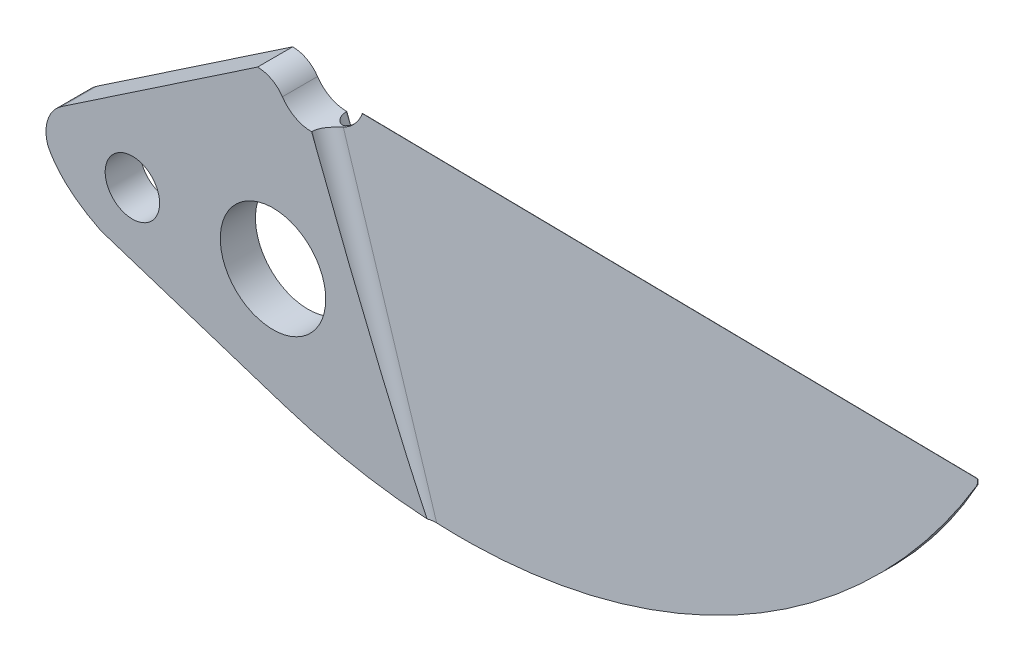
ISO-10303-21;
HEADER;
FILE_DESCRIPTION(('STEP AP214'),'2;1');
FILE_NAME('part.step','',(''),(''),'','','');
FILE_SCHEMA(('AUTOMOTIVE_DESIGN { 1 0 10303 214 1 1 1 1 }'));
ENDSEC;
DATA;
#1=APPLICATION_CONTEXT('core data for automotive mechanical design processes');
#2=APPLICATION_PROTOCOL_DEFINITION('international standard','automotive_design',2000,#1);
#3=PRODUCT_CONTEXT('',#1,'mechanical');
#4=PRODUCT('Part','Part','',(#3));
#5=PRODUCT_RELATED_PRODUCT_CATEGORY('part','',(#4));
#6=PRODUCT_DEFINITION_FORMATION('','',#4);
#7=PRODUCT_DEFINITION_CONTEXT('part definition',#1,'design');
#8=PRODUCT_DEFINITION('design','',#6,#7);
#9=PRODUCT_DEFINITION_SHAPE('','',#8);
#10=(LENGTH_UNIT() NAMED_UNIT(*) SI_UNIT(.MILLI.,.METRE.));
#11=(NAMED_UNIT(*) PLANE_ANGLE_UNIT() SI_UNIT($,.RADIAN.));
#12=(NAMED_UNIT(*) SI_UNIT($,.STERADIAN.) SOLID_ANGLE_UNIT());
#13=UNCERTAINTY_MEASURE_WITH_UNIT(LENGTH_MEASURE(1.E-05),#10,'distance_accuracy_value','');
#14=(GEOMETRIC_REPRESENTATION_CONTEXT(3) GLOBAL_UNCERTAINTY_ASSIGNED_CONTEXT((#13)) GLOBAL_UNIT_ASSIGNED_CONTEXT((#10,
#11,#12)) REPRESENTATION_CONTEXT('',''));
#15=CARTESIAN_POINT('',(0.,0.,0.));
#16=DIRECTION('',(0.,0.,1.));
#17=DIRECTION('',(1.,0.,0.));
#18=AXIS2_PLACEMENT_3D('',#15,#16,#17);
#19=CARTESIAN_POINT('',(8.2800869651625,-5.47751449154035,-1.67389681980654));
#20=DIRECTION('',(0.357944541525714,-0.932477410895465,-0.0485961249652377));
#21=DIRECTION('',(0.933580426497201,0.358367949545303,0.));
#22=AXIS2_PLACEMENT_3D('',#19,#20,#21);
#23=CYLINDRICAL_SURFACE('',#22,0.9);
#24=CARTESIAN_POINT('',(3.31636427381954,7.45342521184956,-1.));
#25=DIRECTION('',(0.,0.,1.));
#26=DIRECTION('',(0.358367949545303,-0.933580426497201,0.));
#27=AXIS2_PLACEMENT_3D('',#24,#25,#26);
#28=ELLIPSE('',#27,18.5199951774714,0.9);
#29=CARTESIAN_POINT('',(2.47614188997207,7.13089405725878,-1.));
#30=VERTEX_POINT('',#29);
#31=CARTESIAN_POINT('',(8.7708872621905,-7.94148829703764,-1.));
#32=VERTEX_POINT('',#31);
#33=EDGE_CURVE('E267',#30,#32,#28,.T.);
#34=ORIENTED_EDGE('',*,*,#33,.F.);
#35=DIRECTION('',(-0.357944541525714,0.932477410895465,0.0485961249652377));
#36=VECTOR('',#35,1.);
#37=CARTESIAN_POINT('',(7.43986458131502,-5.80004564613112,-1.67389681980654));
#38=LINE('',#37,#36);
#39=CARTESIAN_POINT('',(2.2,7.85026827512889,-0.962509762724638));
#40=VERTEX_POINT('',#39);
#41=EDGE_CURVE('E269',#40,#30,#38,.F.);
#42=ORIENTED_EDGE('',*,*,#41,.F.);
#43=CARTESIAN_POINT('',(3.06901821848776,8.04893339900609,-0.0677439758841017));
#44=CARTESIAN_POINT('',(3.04738711886484,8.03849552881779,-0.0683063534846447));
#45=CARTESIAN_POINT('',(3.02559596619507,8.02846610860135,-0.069806209494751));
#46=CARTESIAN_POINT('',(2.98184904882709,8.00926816414383,-0.0746761316194891));
#47=CARTESIAN_POINT('',(2.95989331594161,8.00009947793519,-0.0780458450479244));
#48=CARTESIAN_POINT('',(2.89417392234209,7.97401382623964,-0.0909194408252502));
#49=CARTESIAN_POINT('',(2.85038445244756,7.95843401010548,-0.103192359199342));
#50=CARTESIAN_POINT('',(2.76425472923656,7.93098044075325,-0.134779006636601));
#51=CARTESIAN_POINT('',(2.72191427187643,7.91910616380952,-0.154091739883988));
#52=CARTESIAN_POINT('',(2.63993826613543,7.89879729652735,-0.199216890080445));
#53=CARTESIAN_POINT('',(2.6003042081508,7.89036458891915,-0.225032852203651));
#54=CARTESIAN_POINT('',(2.52380394954619,7.87625929709121,-0.283377957503825));
#55=CARTESIAN_POINT('',(2.48705847577758,7.87067838583808,-0.316087279367703));
#56=CARTESIAN_POINT('',(2.41887969978816,7.86198385016072,-0.38694109927238));
#57=CARTESIAN_POINT('',(2.3874483970294,7.85887115278618,-0.425087633164483));
#58=CARTESIAN_POINT('',(2.3298205576978,7.85426749897936,-0.507650647545117));
#59=CARTESIAN_POINT('',(2.30389647289797,7.85284946357172,-0.552262057947021));
#60=CARTESIAN_POINT('',(2.26016007711158,7.85105282242732,-0.645294988801989));
#61=CARTESIAN_POINT('',(2.24233917328069,7.85067311346634,-0.693712409027086));
#62=CARTESIAN_POINT('',(2.21942194127938,7.85033882020424,-0.779004693557293));
#63=CARTESIAN_POINT('',(2.21215881601434,7.85029488682602,-0.815309427738365));
#64=CARTESIAN_POINT('',(2.20243561216963,7.85026829014279,-0.888571242136176));
#65=CARTESIAN_POINT('',(2.19997765048983,7.85028565383257,-0.92552860263432));
#66=CARTESIAN_POINT('',(2.2,7.85026827512889,-0.962509762724637));
#67=B_SPLINE_CURVE_WITH_KNOTS('',3,(#43,#44,#45,#46,#47,#48,#49,#50,#51,#52,#53,#54,#55,#56,#57,
#58,#59,#60,#61,#62,#63,#64,#65,#66),.UNSPECIFIED.,.F.,.F.,(4,2,2,2,2,2,2,2,2,2,2,4),(0.,
0.0720281930726787,0.1440428050463,0.287501900272176,0.430940710386766,0.574457884681114,
0.722336755169682,0.870271142002736,1.02436509657995,1.17829526224761,1.28906455524821,
1.39988263632901),.UNSPECIFIED.);
#68=CARTESIAN_POINT('',(3.06901821848776,8.04893339900609,-0.0677439758841017));
#69=VERTEX_POINT('',#68);
#70=EDGE_CURVE('E240',#40,#69,#67,.F.);
#71=ORIENTED_EDGE('',*,*,#70,.T.);
#72=DIRECTION('',(-0.357944541525714,0.932477410895465,0.0485961249652377));
#73=VECTOR('',#72,1.);
#74=CARTESIAN_POINT('',(8.27941414294834,-5.52461204653122,-0.775130238527423));
#75=LINE('',#74,#73);
#76=CARTESIAN_POINT('',(9.21616331207181,-7.96492706337582,-0.902307424942313));
#77=VERTEX_POINT('',#76);
#78=EDGE_CURVE('E278',#77,#69,#75,.T.);
#79=ORIENTED_EDGE('',*,*,#78,.F.);
#80=CARTESIAN_POINT('',(8.7708872621905,-7.94148829703764,-1.));
#81=CARTESIAN_POINT('',(8.82487068148805,-7.9447041897844,-0.974670081249899));
#82=CARTESIAN_POINT('',(8.88106165759478,-7.94790601053109,-0.954214629148441));
#83=CARTESIAN_POINT('',(8.99457155644889,-7.95406933881047,-0.923592847691602));
#84=CARTESIAN_POINT('',(9.05181933535197,-7.95703499621789,-0.913164229147659));
#85=CARTESIAN_POINT('',(9.16717355253638,-7.96269676119442,-0.901773544444883));
#86=CARTESIAN_POINT('',(9.22527876930779,-7.96539321637517,-0.900799109756322));
#87=CARTESIAN_POINT('',(9.34250182333011,-7.97052625485149,-0.908328996820005));
#88=CARTESIAN_POINT('',(9.40160325188754,-7.97295359399474,-0.917096085760459));
#89=CARTESIAN_POINT('',(9.45957224124534,-7.97517165401397,-0.930782380070947));
#90=B_SPLINE_CURVE_WITH_KNOTS('',3,(#80,#81,#82,#83,#84,#85,#86,#87,#88,#89),.UNSPECIFIED.,.F.,
.F.,(4,2,2,2,4),(0.,0.178812864998598,0.352809561578287,0.526578594512403,0.70515114895579),.UNSPECIFIED.);
#91=EDGE_CURVE('E248',#77,#32,#90,.F.);
#92=ORIENTED_EDGE('',*,*,#91,.T.);
#93=EDGE_LOOP('',(#34,#42,#71,#79,#92));
#94=FACE_BOUND('',#93,.T.);
#95=ADVANCED_FACE('F39',(#94),#23,.F.);
#96=CARTESIAN_POINT('',(2.2892800924129,10.129070981352,0.860558535082814));
#97=DIRECTION('',(0.357944541525714,-0.932477410895465,0.0485961249652377));
#98=DIRECTION('',(0.933580426497201,0.358367949545303,0.));
#99=AXIS2_PLACEMENT_3D('',#96,#97,#98);
#100=CYLINDRICAL_SURFACE('',#99,0.9);
#101=DIRECTION('',(0.357944541525714,-0.932477410895465,0.0485961249652377));
#102=VECTOR('',#101,1.);
#103=CARTESIAN_POINT('',(2.28860727019875,10.0819734263611,-0.0382080461963024));
#104=LINE('',#103,#102);
#105=CARTESIAN_POINT('',(3.06901821848776,8.04893339900609,0.0677439758841014));
#106=VERTEX_POINT('',#105);
#107=CARTESIAN_POINT('',(9.21616331207183,-7.96492706337582,0.902307424942312));
#108=VERTEX_POINT('',#107);
#109=EDGE_CURVE('E204',#106,#108,#104,.T.);
#110=ORIENTED_EDGE('',*,*,#109,.F.);
#111=CARTESIAN_POINT('',(2.2,7.85026827512889,0.962509762724639));
#112=CARTESIAN_POINT('',(2.19999809804876,7.85027101865456,0.938216920235091));
#113=CARTESIAN_POINT('',(2.20105188369925,7.8502680038347,0.913935927408645));
#114=CARTESIAN_POINT('',(2.20525200459821,7.85027351339869,0.865561870037675));
#115=CARTESIAN_POINT('',(2.20839779874032,7.85028203479924,0.841468758526827));
#116=CARTESIAN_POINT('',(2.22091068799788,7.85035924140511,0.769899367432101));
#117=CARTESIAN_POINT('',(2.2333536582733,7.85047920648801,0.722926549773713));
#118=CARTESIAN_POINT('',(2.26586976038441,7.85128819351617,0.631773449985123));
#119=CARTESIAN_POINT('',(2.28593944181042,7.85197695829512,0.587591915573065));
#120=CARTESIAN_POINT('',(2.33287601008231,7.85454910178014,0.503004556547711));
#121=CARTESIAN_POINT('',(2.35974793379163,7.85643336728422,0.462601560325799));
#122=CARTESIAN_POINT('',(2.42037724220708,7.86220591536161,0.385125042700949));
#123=CARTESIAN_POINT('',(2.45434701741513,7.86616365157841,0.348222914207002));
#124=CARTESIAN_POINT('',(2.52736503777638,7.87689755548643,0.28030967391197));
#125=CARTESIAN_POINT('',(2.56641392329902,7.88367407880488,0.249299306153709));
#126=CARTESIAN_POINT('',(2.64929060716319,7.90091724706654,0.193311690836765));
#127=CARTESIAN_POINT('',(2.69320960868409,7.91146739934345,0.168494529727756));
#128=CARTESIAN_POINT('',(2.783488897118,7.93670359961269,0.126660738807834));
#129=CARTESIAN_POINT('',(2.82984671025603,7.9513855199464,0.109636368313299));
#130=CARTESIAN_POINT('',(2.90865176839282,7.97971310159564,0.0879634290841387));
#131=CARTESIAN_POINT('',(2.94091110695246,7.99224458475626,0.0811090624673443));
#132=CARTESIAN_POINT('',(3.0052385640548,8.01919706361951,0.0714065998367637));
#133=CARTESIAN_POINT('',(3.03730669710264,8.03361791403512,0.0685581959731345));
#134=CARTESIAN_POINT('',(3.06901821848776,8.04893339900609,0.0677439758841018));
#135=B_SPLINE_CURVE_WITH_KNOTS('',3,(#111,#112,#113,#114,#115,#116,#117,#118,#119,#120,#121,
#122,#123,#124,#125,#126,#127,#128,#129,#130,#131,#132,#133,#134),.UNSPECIFIED.,.F.,.F.,(4,2,2,
2,2,2,2,2,2,2,2,4),(0.,0.0728322379780739,0.145645644929881,0.290661316063427,0.435611458436186,
0.580669247771913,0.730929790760232,0.881209296853106,1.035044082627,1.18872572886805,
1.29430211437038,1.39987038610532),.UNSPECIFIED.);
#136=CARTESIAN_POINT('',(2.2,7.85026827512889,0.962509762724639));
#137=VERTEX_POINT('',#136);
#138=EDGE_CURVE('E212',#106,#137,#135,.F.);
#139=ORIENTED_EDGE('',*,*,#138,.T.);
#140=DIRECTION('',(-0.357944541525714,0.932477410895465,-0.0485961249652377));
#141=VECTOR('',#140,1.);
#142=CARTESIAN_POINT('',(1.44905770856542,9.80653982676119,0.860558535082814));
#143=LINE('',#142,#141);
#144=CARTESIAN_POINT('',(2.47614188997207,7.13089405725878,1.));
#145=VERTEX_POINT('',#144);
#146=EDGE_CURVE('E207',#145,#137,#143,.T.);
#147=ORIENTED_EDGE('',*,*,#146,.F.);
#148=CARTESIAN_POINT('',(3.31636427381955,7.45342521184956,1.));
#149=DIRECTION('',(0.,0.,1.));
#150=DIRECTION('',(0.358367949545303,-0.933580426497201,0.));
#151=AXIS2_PLACEMENT_3D('',#148,#149,#150);
#152=ELLIPSE('',#151,18.5199951774714,0.9);
#153=CARTESIAN_POINT('',(8.7708872621905,-7.94148829703764,1.));
#154=VERTEX_POINT('',#153);
#155=EDGE_CURVE('E210',#154,#145,#152,.F.);
#156=ORIENTED_EDGE('',*,*,#155,.F.);
#157=CARTESIAN_POINT('',(8.7708872621905,-7.94148829703764,1.));
#158=CARTESIAN_POINT('',(8.82487068148805,-7.9447041897844,0.974670081249898));
#159=CARTESIAN_POINT('',(8.88106165759478,-7.94790601053109,0.95421462914844));
#160=CARTESIAN_POINT('',(8.99457155644889,-7.95406933881047,0.923592847691601));
#161=CARTESIAN_POINT('',(9.05181933535198,-7.95703499621789,0.913164229147659));
#162=CARTESIAN_POINT('',(9.16717355253638,-7.96269676119442,0.901773544444883));
#163=CARTESIAN_POINT('',(9.22527876930779,-7.96539321637517,0.900799109756322));
#164=CARTESIAN_POINT('',(9.34250182333011,-7.97052625485149,0.908328996820005));
#165=CARTESIAN_POINT('',(9.40160325188755,-7.97295359399474,0.917096085760459));
#166=CARTESIAN_POINT('',(9.45957224124534,-7.97517165401397,0.930782380070948));
#167=B_SPLINE_CURVE_WITH_KNOTS('',3,(#157,#158,#159,#160,#161,#162,#163,#164,#165,#166),
.UNSPECIFIED.,.F.,.F.,(4,2,2,2,4),(0.,0.178812864998599,0.352809561578287,0.526578594512401,
0.705151148955792),.UNSPECIFIED.);
#168=EDGE_CURVE('E220',#154,#108,#167,.T.);
#169=ORIENTED_EDGE('',*,*,#168,.T.);
#170=EDGE_LOOP('',(#110,#139,#147,#156,#169));
#171=FACE_BOUND('',#170,.T.);
#172=ADVANCED_FACE('F227',(#171),#100,.F.);
#173=CARTESIAN_POINT('',(4.5438866935335,1.74423468092352,1.));
#174=DIRECTION('',(0.933580426497201,0.358367949545303,0.));
#175=DIRECTION('',(-0.358367949545303,0.933580426497201,0.));
#176=AXIS2_PLACEMENT_3D('',#173,#174,#175);
#177=PLANE('',#176);
#178=DIRECTION('',(0.,0.,-1.));
#179=VECTOR('',#178,1.);
#180=CARTESIAN_POINT('',(2.2,7.85026827512889,1.));
#181=LINE('',#180,#179);
#182=CARTESIAN_POINT('',(2.2,7.85026827512889,-1.));
#183=VERTEX_POINT('',#182);
#184=EDGE_CURVE('E170',#40,#183,#181,.T.);
#185=ORIENTED_EDGE('',*,*,#184,.F.);
#186=ORIENTED_EDGE('',*,*,#41,.T.);
#187=DIRECTION('',(0.358367949545303,-0.933580426497201,0.));
#188=VECTOR('',#187,1.);
#189=CARTESIAN_POINT('',(4.5438866935335,1.74423468092352,-1.));
#190=LINE('',#189,#188);
#191=EDGE_CURVE('E276',#183,#30,#190,.T.);
#192=ORIENTED_EDGE('',*,*,#191,.F.);
#193=EDGE_LOOP('',(#185,#186,#192));
#194=FACE_BOUND('',#193,.T.);
#195=ADVANCED_FACE('F262',(#194),#177,.T.);
#196=CARTESIAN_POINT('',(-9.8,-3.01889749363505,1.));
#197=CARTESIAN_POINT('',(-12.0163663063261,-1.91939263561892,1.));
#198=CARTESIAN_POINT('',(-12.8,-0.352047083226039,1.));
#199=B_SPLINE_CURVE_WITH_KNOTS('',2,(#196,#197,#198),.UNSPECIFIED.,.F.,.F.,(3,3),(0.,
0.799118897655542),.UNSPECIFIED.);
#200=DIRECTION('',(0.,0.,-1.));
#201=VECTOR('',#200,1.);
#202=SURFACE_OF_LINEAR_EXTRUSION('',#199,#201);
#203=CARTESIAN_POINT('',(-9.8,-3.01889749363505,-1.));
#204=CARTESIAN_POINT('',(-12.0163663063261,-1.91939263561892,-1.));
#205=CARTESIAN_POINT('',(-12.8,-0.352047083226039,-1.));
#206=B_SPLINE_CURVE_WITH_KNOTS('',2,(#203,#204,#205),.UNSPECIFIED.,.F.,.F.,(3,3),(0.,
0.799118897655542),.UNSPECIFIED.);
#207=CARTESIAN_POINT('',(-9.8,-3.01889749363505,-1.));
#208=VERTEX_POINT('',#207);
#209=CARTESIAN_POINT('',(-12.8,-0.352047083226039,-1.));
#210=VERTEX_POINT('',#209);
#211=EDGE_CURVE('E349',#208,#210,#206,.T.);
#212=ORIENTED_EDGE('',*,*,#211,.F.);
#213=DIRECTION('',(0.,0.,-1.));
#214=VECTOR('',#213,1.);
#215=CARTESIAN_POINT('',(-9.8,-3.01889749363505,1.));
#216=LINE('',#215,#214);
#217=CARTESIAN_POINT('',(-9.8,-3.01889749363505,1.));
#218=VERTEX_POINT('',#217);
#219=EDGE_CURVE('E182',#218,#208,#216,.T.);
#220=ORIENTED_EDGE('',*,*,#219,.F.);
#221=CARTESIAN_POINT('',(-12.8,-0.352047083226039,1.));
#222=VERTEX_POINT('',#221);
#223=EDGE_CURVE('E293',#218,#222,#199,.T.);
#224=ORIENTED_EDGE('',*,*,#223,.T.);
#225=DIRECTION('',(0.,0.,-1.));
#226=VECTOR('',#225,1.);
#227=CARTESIAN_POINT('',(-12.8,-0.352047083226039,1.));
#228=LINE('',#227,#226);
#229=EDGE_CURVE('E168',#222,#210,#228,.T.);
#230=ORIENTED_EDGE('',*,*,#229,.T.);
#231=EDGE_LOOP('',(#212,#220,#224,#230));
#232=FACE_BOUND('',#231,.T.);
#233=ADVANCED_FACE('F314',(#232),#202,.T.);
#234=CARTESIAN_POINT('',(-1.82304844003346,-5.61076617136399,1.));
#235=DIRECTION('',(0.309016994374948,0.951056516295153,0.));
#236=DIRECTION('',(-0.951056516295153,0.309016994374948,0.));
#237=AXIS2_PLACEMENT_3D('',#234,#235,#236);
#238=PLANE('',#237);
#239=DIRECTION('',(0.951056516295153,-0.309016994374948,0.));
#240=VECTOR('',#239,1.);
#241=CARTESIAN_POINT('',(-1.82304844003346,-5.61076617136399,-1.));
#242=LINE('',#241,#240);
#243=CARTESIAN_POINT('',(0.59471388474998,-6.396344771496,-1.));
#244=VERTEX_POINT('',#243);
#245=EDGE_CURVE('E287',#208,#244,#242,.T.);
#246=ORIENTED_EDGE('',*,*,#245,.T.);
#247=DIRECTION('',(0.,0.,-1.));
#248=VECTOR('',#247,1.);
#249=CARTESIAN_POINT('',(0.59471388474998,-6.396344771496,1.));
#250=LINE('',#249,#248);
#251=CARTESIAN_POINT('',(0.59471388474998,-6.396344771496,1.));
#252=VERTEX_POINT('',#251);
#253=EDGE_CURVE('E179',#252,#244,#250,.T.);
#254=ORIENTED_EDGE('',*,*,#253,.F.);
#255=DIRECTION('',(0.951056516295153,-0.309016994374948,0.));
#256=VECTOR('',#255,1.);
#257=CARTESIAN_POINT('',(-1.82304844003346,-5.61076617136399,1.));
#258=LINE('',#257,#256);
#259=EDGE_CURVE('E296',#218,#252,#258,.T.);
#260=ORIENTED_EDGE('',*,*,#259,.F.);
#261=ORIENTED_EDGE('',*,*,#219,.T.);
#262=EDGE_LOOP('',(#246,#254,#260,#261));
#263=FACE_BOUND('',#262,.T.);
#264=ADVANCED_FACE('F318',(#263),#238,.F.);
#265=CARTESIAN_POINT('',(10.7150204505295,24.7507561371703,1.));
#266=DIRECTION('',(0.,0.,-1.));
#267=DIRECTION('',(-1.,0.,0.));
#268=AXIS2_PLACEMENT_3D('',#265,#266,#267);
#269=CYLINDRICAL_SURFACE('',#268,32.75);
#270=ORIENTED_EDGE('',*,*,#91,.F.);
#271=CARTESIAN_POINT('',(10.7150204505295,24.7507561371703,0.813196005087186));
#272=DIRECTION('',(0.000747580237950325,0.0523306166565225,-0.998629534754574));
#273=DIRECTION('',(-0.0142646807053726,-0.998527649376075,-0.052335956242951));
#274=AXIS2_PLACEMENT_3D('',#271,#272,#273);
#275=ELLIPSE('',#274,32.7949443314319,32.75);
#276=CARTESIAN_POINT('',(39.0913358163903,8.4,-0.0223807026157854));
#277=VERTEX_POINT('',#276);
#278=EDGE_CURVE('E194',#77,#277,#275,.F.);
#279=ORIENTED_EDGE('',*,*,#278,.T.);
#280=DIRECTION('',(0.,0.,-1.));
#281=VECTOR('',#280,1.);
#282=CARTESIAN_POINT('',(39.0913358163903,8.4,0.95));
#283=LINE('',#282,#281);
#284=CARTESIAN_POINT('',(39.0913358163903,8.4,0.0223807026157856));
#285=VERTEX_POINT('',#284);
#286=EDGE_CURVE('E307',#285,#277,#283,.T.);
#287=ORIENTED_EDGE('',*,*,#286,.F.);
#288=CARTESIAN_POINT('',(10.7150204505295,24.7507561371703,-0.813196005087187));
#289=DIRECTION('',(-0.000747580237950325,-0.0523306166565225,-0.998629534754574));
#290=DIRECTION('',(0.0142646807053726,0.998527649376075,-0.052335956242951));
#291=AXIS2_PLACEMENT_3D('',#288,#289,#290);
#292=ELLIPSE('',#291,32.7949443314319,32.75);
#293=EDGE_CURVE('E189',#285,#108,#292,.T.);
#294=ORIENTED_EDGE('',*,*,#293,.T.);
#295=ORIENTED_EDGE('',*,*,#168,.F.);
#296=CARTESIAN_POINT('',(10.7150204505295,24.7507561371703,1.));
#297=DIRECTION('',(0.,0.,1.));
#298=DIRECTION('',(1.,0.,0.));
#299=AXIS2_PLACEMENT_3D('',#296,#297,#298);
#300=CIRCLE('',#299,32.75);
#301=EDGE_CURVE('E301',#252,#154,#300,.T.);
#302=ORIENTED_EDGE('',*,*,#301,.F.);
#303=ORIENTED_EDGE('',*,*,#253,.T.);
#304=CARTESIAN_POINT('',(10.7150204505295,24.7507561371703,-1.));
#305=DIRECTION('',(0.,0.,1.));
#306=DIRECTION('',(1.,0.,0.));
#307=AXIS2_PLACEMENT_3D('',#304,#305,#306);
#308=CIRCLE('',#307,32.75);
#309=EDGE_CURVE('E284',#244,#32,#308,.T.);
#310=ORIENTED_EDGE('',*,*,#309,.T.);
#311=EDGE_LOOP('',(#270,#279,#287,#294,#295,#302,#303,#310));
#312=FACE_BOUND('',#311,.T.);
#313=ADVANCED_FACE('F343',(#312),#269,.T.);
#314=DIRECTION('',(0.358367949545303,-0.933580426497201,0.));
#315=VECTOR('',#314,1.);
#316=CARTESIAN_POINT('',(4.5438866935335,1.74423468092352,1.));
#317=LINE('',#316,#315);
#318=CARTESIAN_POINT('',(2.2,7.85026827512889,1.));
#319=VERTEX_POINT('',#318);
#320=EDGE_CURVE('E397',#319,#145,#317,.T.);
#321=ORIENTED_EDGE('',*,*,#320,.T.);
#322=ORIENTED_EDGE('',*,*,#146,.T.);
#323=EDGE_CURVE('E176',#319,#137,#181,.T.);
#324=ORIENTED_EDGE('',*,*,#323,.F.);
#325=EDGE_LOOP('',(#321,#322,#324));
#326=FACE_BOUND('',#325,.T.);
#327=ADVANCED_FACE('F235',(#326),#177,.T.);
#328=CARTESIAN_POINT('',(2.2,9.85026827512889,1.));
#329=DIRECTION('',(0.,0.,-1.));
#330=DIRECTION('',(-1.,0.,0.));
#331=AXIS2_PLACEMENT_3D('',#328,#329,#330);
#332=CYLINDRICAL_SURFACE('',#331,2.);
#333=ORIENTED_EDGE('',*,*,#70,.F.);
#334=ORIENTED_EDGE('',*,*,#184,.T.);
#335=CARTESIAN_POINT('',(2.2,9.85026827512889,-1.));
#336=DIRECTION('',(0.,0.,1.));
#337=DIRECTION('',(1.,0.,0.));
#338=AXIS2_PLACEMENT_3D('',#335,#336,#337);
#339=CIRCLE('',#338,2.);
#340=CARTESIAN_POINT('',(0.535135135135134,8.7420151534376,-1.));
#341=VERTEX_POINT('',#340);
#342=EDGE_CURVE('E283',#341,#183,#339,.T.);
#343=ORIENTED_EDGE('',*,*,#342,.F.);
#344=DIRECTION('',(0.,0.,-1.));
#345=VECTOR('',#344,1.);
#346=CARTESIAN_POINT('',(0.535135135135134,8.7420151534376,1.));
#347=LINE('',#346,#345);
#348=CARTESIAN_POINT('',(0.535135135135134,8.7420151534376,1.));
#349=VERTEX_POINT('',#348);
#350=EDGE_CURVE('E167',#349,#341,#347,.T.);
#351=ORIENTED_EDGE('',*,*,#350,.F.);
#352=CARTESIAN_POINT('',(2.2,9.85026827512889,1.));
#353=DIRECTION('',(0.,0.,1.));
#354=DIRECTION('',(1.,0.,0.));
#355=AXIS2_PLACEMENT_3D('',#352,#353,#354);
#356=CIRCLE('',#355,2.);
#357=EDGE_CURVE('E160',#349,#319,#356,.T.);
#358=ORIENTED_EDGE('',*,*,#357,.T.);
#359=ORIENTED_EDGE('',*,*,#323,.T.);
#360=ORIENTED_EDGE('',*,*,#138,.F.);
#361=CARTESIAN_POINT('',(2.2,9.85026827512889,-0.0259998007295693));
#362=DIRECTION('',(-0.000747580237950325,-0.0523306166565225,-0.998629534754574));
#363=DIRECTION('',(0.0142646807053726,0.998527649376075,-0.052335956242951));
#364=AXIS2_PLACEMENT_3D('',#361,#362,#363);
#365=ELLIPSE('',#364,2.00274469199584,2.);
#366=CARTESIAN_POINT('',(4.09133581639034,9.2,0.00665997290512789));
#367=VERTEX_POINT('',#366);
#368=EDGE_CURVE('E192',#106,#367,#365,.F.);
#369=ORIENTED_EDGE('',*,*,#368,.T.);
#370=DIRECTION('',(0.,0.,-1.));
#371=VECTOR('',#370,1.);
#372=CARTESIAN_POINT('',(4.09133581639034,9.2,0.95));
#373=LINE('',#372,#371);
#374=CARTESIAN_POINT('',(4.09133581639034,9.2,-0.00665997290512745));
#375=VERTEX_POINT('',#374);
#376=EDGE_CURVE('E150',#367,#375,#373,.T.);
#377=ORIENTED_EDGE('',*,*,#376,.T.);
#378=CARTESIAN_POINT('',(2.2,9.85026827512889,0.0259998007295691));
#379=DIRECTION('',(0.000747580237950325,0.0523306166565225,-0.998629534754574));
#380=DIRECTION('',(-0.0142646807053726,-0.998527649376075,-0.052335956242951));
#381=AXIS2_PLACEMENT_3D('',#378,#379,#380);
#382=ELLIPSE('',#381,2.00274469199584,2.);
#383=EDGE_CURVE('E201',#375,#69,#382,.T.);
#384=ORIENTED_EDGE('',*,*,#383,.T.);
#385=EDGE_LOOP('',(#333,#334,#343,#351,#358,#359,#360,#369,#377,#384));
#386=FACE_BOUND('',#385,.T.);
#387=ADVANCED_FACE('F230',(#386),#332,.F.);
#388=CARTESIAN_POINT('',(-0.880000000000001,7.8,1.));
#389=DIRECTION('',(0.,0.,-1.));
#390=DIRECTION('',(-1.,0.,0.));
#391=AXIS2_PLACEMENT_3D('',#388,#389,#390);
#392=CYLINDRICAL_SURFACE('',#391,1.7);
#393=CARTESIAN_POINT('',(-0.880000000000001,7.8,-1.));
#394=DIRECTION('',(0.,0.,1.));
#395=DIRECTION('',(1.,0.,0.));
#396=AXIS2_PLACEMENT_3D('',#393,#394,#395);
#397=CIRCLE('',#396,1.7);
#398=CARTESIAN_POINT('',(-0.880000000000001,9.5,-1.));
#399=VERTEX_POINT('',#398);
#400=EDGE_CURVE('E166',#341,#399,#397,.T.);
#401=ORIENTED_EDGE('',*,*,#400,.T.);
#402=DIRECTION('',(0.,0.,-1.));
#403=VECTOR('',#402,1.);
#404=CARTESIAN_POINT('',(-0.880000000000001,9.5,1.));
#405=LINE('',#404,#403);
#406=CARTESIAN_POINT('',(-0.880000000000001,9.5,1.));
#407=VERTEX_POINT('',#406);
#408=EDGE_CURVE('E146',#407,#399,#405,.T.);
#409=ORIENTED_EDGE('',*,*,#408,.F.);
#410=CARTESIAN_POINT('',(-0.880000000000001,7.8,1.));
#411=DIRECTION('',(0.,0.,1.));
#412=DIRECTION('',(1.,0.,0.));
#413=AXIS2_PLACEMENT_3D('',#410,#411,#412);
#414=CIRCLE('',#413,1.7);
#415=EDGE_CURVE('E155',#349,#407,#414,.T.);
#416=ORIENTED_EDGE('',*,*,#415,.F.);
#417=ORIENTED_EDGE('',*,*,#350,.T.);
#418=EDGE_LOOP('',(#401,#409,#416,#417));
#419=FACE_BOUND('',#418,.T.);
#420=ADVANCED_FACE('F164',(#419),#392,.T.);
#421=CARTESIAN_POINT('',(0.,0.,1.));
#422=DIRECTION('',(0.,0.,-1.));
#423=DIRECTION('',(-1.,0.,0.));
#424=AXIS2_PLACEMENT_3D('',#421,#422,#423);
#425=CYLINDRICAL_SURFACE('',#424,3.00000000000001);
#426=CARTESIAN_POINT('',(0.,0.,1.));
#427=DIRECTION('',(0.,0.,1.));
#428=DIRECTION('',(1.,0.,0.));
#429=AXIS2_PLACEMENT_3D('',#426,#427,#428);
#430=CIRCLE('',#429,3.00000000000001);
#431=CARTESIAN_POINT('',(3.00000000000001,0.,1.));
#432=VERTEX_POINT('',#431);
#433=EDGE_CURVE('E162',#432,#432,#430,.T.);
#434=ORIENTED_EDGE('',*,*,#433,.T.);
#435=EDGE_LOOP('',(#434));
#436=FACE_BOUND('',#435,.T.);
#437=CARTESIAN_POINT('',(0.,0.,-1.));
#438=DIRECTION('',(0.,0.,1.));
#439=DIRECTION('',(1.,0.,0.));
#440=AXIS2_PLACEMENT_3D('',#437,#438,#439);
#441=CIRCLE('',#440,3.00000000000001);
#442=CARTESIAN_POINT('',(3.00000000000001,0.,-1.));
#443=VERTEX_POINT('',#442);
#444=EDGE_CURVE('E291',#443,#443,#441,.T.);
#445=ORIENTED_EDGE('',*,*,#444,.F.);
#446=EDGE_LOOP('',(#445));
#447=FACE_BOUND('',#446,.T.);
#448=ADVANCED_FACE('F371',(#436,#447),#425,.F.);
#449=CARTESIAN_POINT('',(0.,0.,1.));
#450=DIRECTION('',(0.,0.,1.));
#451=DIRECTION('',(1.,0.,0.));
#452=AXIS2_PLACEMENT_3D('',#449,#450,#451);
#453=PLANE('',#452);
#454=CARTESIAN_POINT('',(-8.,0.,1.));
#455=DIRECTION('',(0.,0.,1.));
#456=DIRECTION('',(1.,0.,0.));
#457=AXIS2_PLACEMENT_3D('',#454,#455,#456);
#458=CIRCLE('',#457,1.55);
#459=CARTESIAN_POINT('',(-6.45,0.,1.));
#460=VERTEX_POINT('',#459);
#461=EDGE_CURVE('E151',#460,#460,#458,.T.);
#462=ORIENTED_EDGE('',*,*,#461,.F.);
#463=EDGE_LOOP('',(#462));
#464=FACE_BOUND('',#463,.T.);
#465=DIRECTION('',(0.829037572555039,0.559192903470751,0.));
#466=VECTOR('',#465,1.);
#467=CARTESIAN_POINT('',(-0.880000000000001,9.5,1.));
#468=LINE('',#467,#466);
#469=CARTESIAN_POINT('',(-12.0341038711579,1.97646194115885,1.));
#470=VERTEX_POINT('',#469);
#471=EDGE_CURVE('E142',#470,#407,#468,.T.);
#472=ORIENTED_EDGE('',*,*,#471,.F.);
#473=CARTESIAN_POINT('',(-10.9157180642164,0.318386796048776,1.));
#474=DIRECTION('',(0.,0.,1.));
#475=DIRECTION('',(1.,0.,0.));
#476=AXIS2_PLACEMENT_3D('',#473,#474,#475);
#477=CIRCLE('',#476,2.);
#478=EDGE_CURVE('E11',#470,#222,#477,.T.);
#479=ORIENTED_EDGE('',*,*,#478,.T.);
#480=ORIENTED_EDGE('',*,*,#223,.F.);
#481=ORIENTED_EDGE('',*,*,#259,.T.);
#482=ORIENTED_EDGE('',*,*,#301,.T.);
#483=ORIENTED_EDGE('',*,*,#155,.T.);
#484=ORIENTED_EDGE('',*,*,#320,.F.);
#485=ORIENTED_EDGE('',*,*,#357,.F.);
#486=ORIENTED_EDGE('',*,*,#415,.T.);
#487=EDGE_LOOP('',(#472,#479,#480,#481,#482,#483,#484,#485,#486));
#488=FACE_BOUND('',#487,.T.);
#489=ORIENTED_EDGE('',*,*,#433,.F.);
#490=EDGE_LOOP('',(#489));
#491=FACE_BOUND('',#490,.T.);
#492=ADVANCED_FACE('F156',(#464,#488,#491),#453,.T.);
#493=CARTESIAN_POINT('',(0.,0.,-1.));
#494=DIRECTION('',(0.,0.,1.));
#495=DIRECTION('',(1.,0.,0.));
#496=AXIS2_PLACEMENT_3D('',#493,#494,#495);
#497=PLANE('',#496);
#498=CARTESIAN_POINT('',(-8.,0.,-1.));
#499=DIRECTION('',(0.,0.,-1.));
#500=DIRECTION('',(-1.,0.,0.));
#501=AXIS2_PLACEMENT_3D('',#498,#499,#500);
#502=CIRCLE('',#501,1.55);
#503=CARTESIAN_POINT('',(-9.55,0.,-1.));
#504=VERTEX_POINT('',#503);
#505=EDGE_CURVE('E358',#504,#504,#502,.T.);
#506=ORIENTED_EDGE('',*,*,#505,.F.);
#507=EDGE_LOOP('',(#506));
#508=FACE_BOUND('',#507,.T.);
#509=ORIENTED_EDGE('',*,*,#211,.T.);
#510=CARTESIAN_POINT('',(-10.9157180642164,0.318386796048776,-1.));
#511=DIRECTION('',(0.,0.,1.));
#512=DIRECTION('',(1.,0.,0.));
#513=AXIS2_PLACEMENT_3D('',#510,#511,#512);
#514=CIRCLE('',#513,2.);
#515=CARTESIAN_POINT('',(-12.0341038711579,1.97646194115885,-1.));
#516=VERTEX_POINT('',#515);
#517=EDGE_CURVE('E61',#210,#516,#514,.F.);
#518=ORIENTED_EDGE('',*,*,#517,.T.);
#519=DIRECTION('',(0.829037572555039,0.559192903470751,0.));
#520=VECTOR('',#519,1.);
#521=CARTESIAN_POINT('',(-4.67929640808926,6.93734221473492,-1.));
#522=LINE('',#521,#520);
#523=EDGE_CURVE('E247',#516,#399,#522,.T.);
#524=ORIENTED_EDGE('',*,*,#523,.T.);
#525=ORIENTED_EDGE('',*,*,#400,.F.);
#526=ORIENTED_EDGE('',*,*,#342,.T.);
#527=ORIENTED_EDGE('',*,*,#191,.T.);
#528=ORIENTED_EDGE('',*,*,#33,.T.);
#529=ORIENTED_EDGE('',*,*,#309,.F.);
#530=ORIENTED_EDGE('',*,*,#245,.F.);
#531=EDGE_LOOP('',(#509,#518,#524,#525,#526,#527,#528,#529,#530));
#532=FACE_BOUND('',#531,.T.);
#533=ORIENTED_EDGE('',*,*,#444,.T.);
#534=EDGE_LOOP('',(#533));
#535=FACE_BOUND('',#534,.T.);
#536=ADVANCED_FACE('F280',(#508,#532,#535),#497,.F.);
#537=CARTESIAN_POINT('',(39.0913358163905,9.04168772639804E-13,0.95));
#538=DIRECTION('',(1.,0.,0.));
#539=DIRECTION('',(0.,1.,0.));
#540=AXIS2_PLACEMENT_3D('',#537,#538,#539);
#541=PLANE('',#540);
#542=ORIENTED_EDGE('',*,*,#286,.T.);
#543=DIRECTION('',(0.,0.998629813809837,0.0523306312796971));
#544=VECTOR('',#543,1.);
#545=CARTESIAN_POINT('',(39.0913358163905,0.0738189314322085,-0.45869284295229));
#546=LINE('',#545,#544);
#547=CARTESIAN_POINT('',(39.0913358163903,8.7,-0.00665997290512745));
#548=VERTEX_POINT('',#547);
#549=EDGE_CURVE('E196',#277,#548,#546,.T.);
#550=ORIENTED_EDGE('',*,*,#549,.T.);
#551=DIRECTION('',(0.,0.,-1.));
#552=VECTOR('',#551,1.);
#553=CARTESIAN_POINT('',(39.0913358163903,8.7,0.95));
#554=LINE('',#553,#552);
#555=CARTESIAN_POINT('',(39.0913358163903,8.7,0.00665997290512789));
#556=VERTEX_POINT('',#555);
#557=EDGE_CURVE('E350',#556,#548,#554,.T.);
#558=ORIENTED_EDGE('',*,*,#557,.F.);
#559=DIRECTION('',(0.,0.998629813809837,-0.0523306312796971));
#560=VECTOR('',#559,1.);
#561=CARTESIAN_POINT('',(39.0913358163905,-0.0254730328534421,0.463895983395541));
#562=LINE('',#561,#560);
#563=EDGE_CURVE('E187',#556,#285,#562,.F.);
#564=ORIENTED_EDGE('',*,*,#563,.T.);
#565=EDGE_LOOP('',(#542,#550,#558,#564));
#566=FACE_BOUND('',#565,.T.);
#567=ADVANCED_FACE('F346',(#566),#541,.T.);
#568=CARTESIAN_POINT('',(0.132236550870515,9.256558560936,0.95));
#569=DIRECTION('',(0.0142842567828502,0.99989797479951,0.));
#570=DIRECTION('',(-0.99989797479951,0.0142842567828502,0.));
#571=AXIS2_PLACEMENT_3D('',#568,#569,#570);
#572=PLANE('',#571);
#573=ORIENTED_EDGE('',*,*,#557,.T.);
#574=DIRECTION('',(-0.99989797479951,0.0142842567828502,0.));
#575=VECTOR('',#574,1.);
#576=CARTESIAN_POINT('',(4.09133581639034,9.2,-0.00665997290512762));
#577=LINE('',#576,#575);
#578=EDGE_CURVE('E198',#548,#375,#577,.T.);
#579=ORIENTED_EDGE('',*,*,#578,.T.);
#580=ORIENTED_EDGE('',*,*,#376,.F.);
#581=DIRECTION('',(0.99989797479951,-0.0142842567828502,0.));
#582=VECTOR('',#581,1.);
#583=CARTESIAN_POINT('',(0.132236550870515,9.256558560936,0.00665997290512767));
#584=LINE('',#583,#582);
#585=EDGE_CURVE('E184',#367,#556,#584,.T.);
#586=ORIENTED_EDGE('',*,*,#585,.T.);
#587=EDGE_LOOP('',(#573,#579,#580,#586));
#588=FACE_BOUND('',#587,.T.);
#589=ADVANCED_FACE('F326',(#588),#572,.T.);
#590=CARTESIAN_POINT('',(0.132236550870515,9.256558560936,0.00665997290512767));
#591=DIRECTION('',(-0.000747580237950325,-0.0523306166565225,-0.998629534754574));
#592=DIRECTION('',(0.99989797479951,-0.0142842567828502,0.));
#593=AXIS2_PLACEMENT_3D('',#590,#591,#592);
#594=PLANE('',#593);
#595=ORIENTED_EDGE('',*,*,#368,.F.);
#596=ORIENTED_EDGE('',*,*,#109,.T.);
#597=ORIENTED_EDGE('',*,*,#293,.F.);
#598=ORIENTED_EDGE('',*,*,#563,.F.);
#599=ORIENTED_EDGE('',*,*,#585,.F.);
#600=EDGE_LOOP('',(#595,#596,#597,#598,#599));
#601=FACE_BOUND('',#600,.T.);
#602=ADVANCED_FACE('F320',(#601),#594,.F.);
#603=CARTESIAN_POINT('',(-0.124880071220789,-8.74160498545519,-0.95));
#604=DIRECTION('',(0.000747580237950325,0.0523306166565225,-0.998629534754574));
#605=DIRECTION('',(-0.99989797479951,0.0142842567828502,0.));
#606=AXIS2_PLACEMENT_3D('',#603,#604,#605);
#607=PLANE('',#606);
#608=ORIENTED_EDGE('',*,*,#278,.F.);
#609=ORIENTED_EDGE('',*,*,#78,.T.);
#610=ORIENTED_EDGE('',*,*,#383,.F.);
#611=ORIENTED_EDGE('',*,*,#578,.F.);
#612=ORIENTED_EDGE('',*,*,#549,.F.);
#613=EDGE_LOOP('',(#608,#609,#610,#611,#612));
#614=FACE_BOUND('',#613,.T.);
#615=ADVANCED_FACE('F325',(#614),#607,.T.);
#616=CARTESIAN_POINT('',(-0.880000000000001,9.5,-9.));
#617=DIRECTION('',(0.559192903470751,-0.829037572555039,0.));
#618=DIRECTION('',(0.829037572555039,0.559192903470751,0.));
#619=AXIS2_PLACEMENT_3D('',#616,#617,#618);
#620=PLANE('',#619);
#621=ORIENTED_EDGE('',*,*,#523,.F.);
#622=DIRECTION('',(0.,0.,-1.));
#623=VECTOR('',#622,1.);
#624=CARTESIAN_POINT('',(-12.0341038711579,1.97646194115885,-9.));
#625=LINE('',#624,#623);
#626=EDGE_CURVE('E47',#516,#470,#625,.F.);
#627=ORIENTED_EDGE('',*,*,#626,.T.);
#628=ORIENTED_EDGE('',*,*,#471,.T.);
#629=ORIENTED_EDGE('',*,*,#408,.T.);
#630=EDGE_LOOP('',(#621,#627,#628,#629));
#631=FACE_BOUND('',#630,.T.);
#632=ADVANCED_FACE('F144',(#631),#620,.F.);
#633=CARTESIAN_POINT('',(-10.9157180642164,0.318386796048776,0.));
#634=DIRECTION('',(0.,0.,-1.));
#635=DIRECTION('',(-1.,0.,0.));
#636=AXIS2_PLACEMENT_3D('',#633,#634,#635);
#637=CYLINDRICAL_SURFACE('',#636,2.);
#638=ORIENTED_EDGE('',*,*,#478,.F.);
#639=ORIENTED_EDGE('',*,*,#626,.F.);
#640=ORIENTED_EDGE('',*,*,#517,.F.);
#641=ORIENTED_EDGE('',*,*,#229,.F.);
#642=EDGE_LOOP('',(#638,#639,#640,#641));
#643=FACE_BOUND('',#642,.T.);
#644=ADVANCED_FACE('F41',(#643),#637,.T.);
#645=CARTESIAN_POINT('',(-8.,0.,1.05998206621894));
#646=DIRECTION('',(0.,0.,-1.));
#647=DIRECTION('',(-1.,0.,0.));
#648=AXIS2_PLACEMENT_3D('',#645,#646,#647);
#649=CYLINDRICAL_SURFACE('',#648,1.55);
#650=ORIENTED_EDGE('',*,*,#461,.T.);
#651=EDGE_LOOP('',(#650));
#652=FACE_BOUND('',#651,.T.);
#653=ORIENTED_EDGE('',*,*,#505,.T.);
#654=EDGE_LOOP('',(#653));
#655=FACE_BOUND('',#654,.T.);
#656=ADVANCED_FACE('F362',(#652,#655),#649,.F.);
#657=CLOSED_SHELL('',(#95,#172,#195,#233,#264,#313,#327,#387,#420,#448,#492,#536,#567,#589,#602,
#615,#632,#644,#656));
#658=MANIFOLD_SOLID_BREP('B2',#657);
#659=ADVANCED_BREP_SHAPE_REPRESENTATION('',(#18,#658),#14);
#660=SHAPE_DEFINITION_REPRESENTATION(#9,#659);
ENDSEC;
END-ISO-10303-21;
